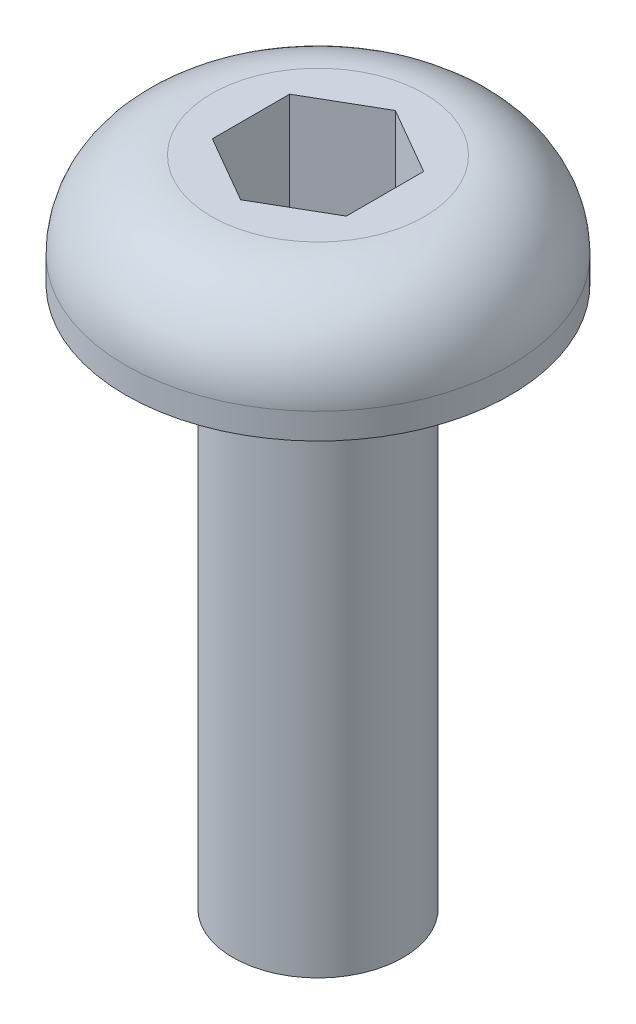
ISO-10303-21;
HEADER;
FILE_DESCRIPTION(('STEP AP214'),'2;1');
FILE_NAME('part.step','',(''),(''),'','','');
FILE_SCHEMA(('AUTOMOTIVE_DESIGN { 1 0 10303 214 1 1 1 1 }'));
ENDSEC;
DATA;
#1=APPLICATION_CONTEXT('core data for automotive mechanical design processes');
#2=APPLICATION_PROTOCOL_DEFINITION('international standard','automotive_design',2000,#1);
#3=PRODUCT_CONTEXT('',#1,'mechanical');
#4=PRODUCT('Part','Part','',(#3));
#5=PRODUCT_RELATED_PRODUCT_CATEGORY('part','',(#4));
#6=PRODUCT_DEFINITION_FORMATION('','',#4);
#7=PRODUCT_DEFINITION_CONTEXT('part definition',#1,'design');
#8=PRODUCT_DEFINITION('design','',#6,#7);
#9=PRODUCT_DEFINITION_SHAPE('','',#8);
#10=(LENGTH_UNIT() NAMED_UNIT(*) SI_UNIT(.MILLI.,.METRE.));
#11=(NAMED_UNIT(*) PLANE_ANGLE_UNIT() SI_UNIT($,.RADIAN.));
#12=(NAMED_UNIT(*) SI_UNIT($,.STERADIAN.) SOLID_ANGLE_UNIT());
#13=UNCERTAINTY_MEASURE_WITH_UNIT(LENGTH_MEASURE(1.E-05),#10,'distance_accuracy_value','');
#14=(GEOMETRIC_REPRESENTATION_CONTEXT(3) GLOBAL_UNCERTAINTY_ASSIGNED_CONTEXT((#13)) GLOBAL_UNIT_ASSIGNED_CONTEXT((#10,
#11,#12)) REPRESENTATION_CONTEXT('',''));
#15=CARTESIAN_POINT('',(0.,0.,0.));
#16=DIRECTION('',(0.,0.,1.));
#17=DIRECTION('',(1.,0.,0.));
#18=AXIS2_PLACEMENT_3D('',#15,#16,#17);
#19=CARTESIAN_POINT('',(0.,0.,0.));
#20=DIRECTION('',(0.,1.,0.));
#21=DIRECTION('',(0.,0.,1.));
#22=AXIS2_PLACEMENT_3D('',#19,#20,#21);
#23=PLANE('',#22);
#24=DIRECTION('',(0.,0.,1.));
#25=VECTOR('',#24,1.);
#26=CARTESIAN_POINT('',(-0.9906,0.,-0.571923176659243));
#27=LINE('',#26,#25);
#28=CARTESIAN_POINT('',(-0.9906,0.,-0.571923176659243));
#29=VERTEX_POINT('',#28);
#30=CARTESIAN_POINT('',(-0.9906,0.,0.571923176659243));
#31=VERTEX_POINT('',#30);
#32=EDGE_CURVE('E82',#29,#31,#27,.T.);
#33=ORIENTED_EDGE('',*,*,#32,.T.);
#34=DIRECTION('',(0.866025403784439,0.,0.5));
#35=VECTOR('',#34,1.);
#36=CARTESIAN_POINT('',(-0.9906,0.,0.571923176659243));
#37=LINE('',#36,#35);
#38=CARTESIAN_POINT('',(0.,0.,1.14384635331849));
#39=VERTEX_POINT('',#38);
#40=EDGE_CURVE('E66',#31,#39,#37,.T.);
#41=ORIENTED_EDGE('',*,*,#40,.T.);
#42=DIRECTION('',(0.866025403784439,0.,-0.5));
#43=VECTOR('',#42,1.);
#44=CARTESIAN_POINT('',(0.,0.,1.14384635331849));
#45=LINE('',#44,#43);
#46=CARTESIAN_POINT('',(0.9906,0.,0.571923176659243));
#47=VERTEX_POINT('',#46);
#48=EDGE_CURVE('E71',#39,#47,#45,.T.);
#49=ORIENTED_EDGE('',*,*,#48,.T.);
#50=DIRECTION('',(0.,0.,-1.));
#51=VECTOR('',#50,1.);
#52=CARTESIAN_POINT('',(0.9906,0.,0.571923176659243));
#53=LINE('',#52,#51);
#54=CARTESIAN_POINT('',(0.9906,0.,-0.571923176659243));
#55=VERTEX_POINT('',#54);
#56=EDGE_CURVE('E131',#47,#55,#53,.T.);
#57=ORIENTED_EDGE('',*,*,#56,.T.);
#58=DIRECTION('',(-0.866025403784439,0.,-0.5));
#59=VECTOR('',#58,1.);
#60=CARTESIAN_POINT('',(0.9906,0.,-0.571923176659243));
#61=LINE('',#60,#59);
#62=CARTESIAN_POINT('',(0.,0.,-1.14384635331849));
#63=VERTEX_POINT('',#62);
#64=EDGE_CURVE('E141',#55,#63,#61,.T.);
#65=ORIENTED_EDGE('',*,*,#64,.T.);
#66=DIRECTION('',(-0.866025403784439,0.,0.5));
#67=VECTOR('',#66,1.);
#68=CARTESIAN_POINT('',(0.,0.,-1.14384635331849));
#69=LINE('',#68,#67);
#70=EDGE_CURVE('E146',#63,#29,#69,.T.);
#71=ORIENTED_EDGE('',*,*,#70,.T.);
#72=EDGE_LOOP('',(#33,#41,#49,#57,#65,#71));
#73=FACE_BOUND('',#72,.T.);
#74=ADVANCED_FACE('F16',(#73),#23,.T.);
#75=CARTESIAN_POINT('',(0.,0.,1.14384635331849));
#76=DIRECTION('',(0.5,0.,0.866025403784439));
#77=DIRECTION('',(0.866025403784439,0.,-0.5));
#78=AXIS2_PLACEMENT_3D('',#75,#76,#77);
#79=PLANE('',#78);
#80=DIRECTION('',(0.,1.,0.));
#81=VECTOR('',#80,1.);
#82=CARTESIAN_POINT('',(0.,0.,1.14384635331849));
#83=LINE('',#82,#81);
#84=CARTESIAN_POINT('',(0.,1.651,1.14384635331849));
#85=VERTEX_POINT('',#84);
#86=EDGE_CURVE('E73',#39,#85,#83,.T.);
#87=ORIENTED_EDGE('',*,*,#86,.T.);
#88=DIRECTION('',(-0.866025403784439,0.,0.5));
#89=VECTOR('',#88,1.);
#90=CARTESIAN_POINT('',(0.9906,1.651,0.571923176659243));
#91=LINE('',#90,#89);
#92=CARTESIAN_POINT('',(0.9906,1.651,0.571923176659243));
#93=VERTEX_POINT('',#92);
#94=EDGE_CURVE('E138',#93,#85,#91,.T.);
#95=ORIENTED_EDGE('',*,*,#94,.F.);
#96=DIRECTION('',(0.,1.,0.));
#97=VECTOR('',#96,1.);
#98=CARTESIAN_POINT('',(0.9906,0.,0.571923176659243));
#99=LINE('',#98,#97);
#100=EDGE_CURVE('E76',#93,#47,#99,.F.);
#101=ORIENTED_EDGE('',*,*,#100,.T.);
#102=ORIENTED_EDGE('',*,*,#48,.F.);
#103=EDGE_LOOP('',(#87,#95,#101,#102));
#104=FACE_BOUND('',#103,.T.);
#105=ADVANCED_FACE('F72',(#104),#79,.F.);
#106=CARTESIAN_POINT('',(-0.9906,0.,0.571923176659243));
#107=DIRECTION('',(-0.5,0.,0.866025403784439));
#108=DIRECTION('',(0.866025403784439,0.,0.5));
#109=AXIS2_PLACEMENT_3D('',#106,#107,#108);
#110=PLANE('',#109);
#111=DIRECTION('',(0.,1.,0.));
#112=VECTOR('',#111,1.);
#113=CARTESIAN_POINT('',(-0.9906,0.,0.571923176659243));
#114=LINE('',#113,#112);
#115=CARTESIAN_POINT('',(-0.9906,1.651,0.571923176659243));
#116=VERTEX_POINT('',#115);
#117=EDGE_CURVE('E84',#31,#116,#114,.T.);
#118=ORIENTED_EDGE('',*,*,#117,.T.);
#119=DIRECTION('',(-0.866025403784439,0.,-0.5));
#120=VECTOR('',#119,1.);
#121=CARTESIAN_POINT('',(0.,1.651,1.14384635331849));
#122=LINE('',#121,#120);
#123=EDGE_CURVE('E88',#85,#116,#122,.T.);
#124=ORIENTED_EDGE('',*,*,#123,.F.);
#125=ORIENTED_EDGE('',*,*,#86,.F.);
#126=ORIENTED_EDGE('',*,*,#40,.F.);
#127=EDGE_LOOP('',(#118,#124,#125,#126));
#128=FACE_BOUND('',#127,.T.);
#129=ADVANCED_FACE('F86',(#128),#110,.F.);
#130=CARTESIAN_POINT('',(-0.9906,0.,-0.571923176659243));
#131=DIRECTION('',(-1.,0.,0.));
#132=DIRECTION('',(0.,0.,1.));
#133=AXIS2_PLACEMENT_3D('',#130,#131,#132);
#134=PLANE('',#133);
#135=DIRECTION('',(0.,1.,0.));
#136=VECTOR('',#135,1.);
#137=CARTESIAN_POINT('',(-0.9906,0.,-0.571923176659243));
#138=LINE('',#137,#136);
#139=CARTESIAN_POINT('',(-0.9906,1.651,-0.571923176659243));
#140=VERTEX_POINT('',#139);
#141=EDGE_CURVE('E148',#29,#140,#138,.T.);
#142=ORIENTED_EDGE('',*,*,#141,.T.);
#143=DIRECTION('',(0.,0.,1.));
#144=VECTOR('',#143,1.);
#145=CARTESIAN_POINT('',(-0.9906,1.651,0.));
#146=LINE('',#145,#144);
#147=EDGE_CURVE('E153',#116,#140,#146,.F.);
#148=ORIENTED_EDGE('',*,*,#147,.F.);
#149=ORIENTED_EDGE('',*,*,#117,.F.);
#150=ORIENTED_EDGE('',*,*,#32,.F.);
#151=EDGE_LOOP('',(#142,#148,#149,#150));
#152=FACE_BOUND('',#151,.T.);
#153=ADVANCED_FACE('F154',(#152),#134,.F.);
#154=CARTESIAN_POINT('',(0.,0.,-1.14384635331849));
#155=DIRECTION('',(-0.5,0.,-0.866025403784439));
#156=DIRECTION('',(-0.866025403784439,0.,0.5));
#157=AXIS2_PLACEMENT_3D('',#154,#155,#156);
#158=PLANE('',#157);
#159=DIRECTION('',(0.,1.,0.));
#160=VECTOR('',#159,1.);
#161=CARTESIAN_POINT('',(0.,0.,-1.14384635331849));
#162=LINE('',#161,#160);
#163=CARTESIAN_POINT('',(0.,1.651,-1.14384635331849));
#164=VERTEX_POINT('',#163);
#165=EDGE_CURVE('E144',#63,#164,#162,.T.);
#166=ORIENTED_EDGE('',*,*,#165,.T.);
#167=DIRECTION('',(0.866025403784439,0.,-0.5));
#168=VECTOR('',#167,1.);
#169=CARTESIAN_POINT('',(-0.9906,1.651,-0.571923176659243));
#170=LINE('',#169,#168);
#171=EDGE_CURVE('E159',#140,#164,#170,.T.);
#172=ORIENTED_EDGE('',*,*,#171,.F.);
#173=ORIENTED_EDGE('',*,*,#141,.F.);
#174=ORIENTED_EDGE('',*,*,#70,.F.);
#175=EDGE_LOOP('',(#166,#172,#173,#174));
#176=FACE_BOUND('',#175,.T.);
#177=ADVANCED_FACE('F181',(#176),#158,.F.);
#178=CARTESIAN_POINT('',(0.9906,0.,-0.571923176659243));
#179=DIRECTION('',(0.5,0.,-0.866025403784439));
#180=DIRECTION('',(-0.866025403784439,0.,-0.5));
#181=AXIS2_PLACEMENT_3D('',#178,#179,#180);
#182=PLANE('',#181);
#183=DIRECTION('',(0.,1.,0.));
#184=VECTOR('',#183,1.);
#185=CARTESIAN_POINT('',(0.9906,0.,-0.571923176659243));
#186=LINE('',#185,#184);
#187=CARTESIAN_POINT('',(0.9906,1.651,-0.571923176659243));
#188=VERTEX_POINT('',#187);
#189=EDGE_CURVE('E34',#55,#188,#186,.T.);
#190=ORIENTED_EDGE('',*,*,#189,.T.);
#191=DIRECTION('',(0.866025403784439,0.,0.5));
#192=VECTOR('',#191,1.);
#193=CARTESIAN_POINT('',(0.,1.651,-1.14384635331849));
#194=LINE('',#193,#192);
#195=EDGE_CURVE('E167',#164,#188,#194,.T.);
#196=ORIENTED_EDGE('',*,*,#195,.F.);
#197=ORIENTED_EDGE('',*,*,#165,.F.);
#198=ORIENTED_EDGE('',*,*,#64,.F.);
#199=EDGE_LOOP('',(#190,#196,#197,#198));
#200=FACE_BOUND('',#199,.T.);
#201=ADVANCED_FACE('F179',(#200),#182,.F.);
#202=CARTESIAN_POINT('',(0.9906,0.,0.571923176659243));
#203=DIRECTION('',(1.,0.,0.));
#204=DIRECTION('',(0.,0.,-1.));
#205=AXIS2_PLACEMENT_3D('',#202,#203,#204);
#206=PLANE('',#205);
#207=ORIENTED_EDGE('',*,*,#100,.F.);
#208=DIRECTION('',(0.,0.,1.));
#209=VECTOR('',#208,1.);
#210=CARTESIAN_POINT('',(0.9906,1.651,0.));
#211=LINE('',#210,#209);
#212=EDGE_CURVE('E105',#188,#93,#211,.T.);
#213=ORIENTED_EDGE('',*,*,#212,.F.);
#214=ORIENTED_EDGE('',*,*,#189,.F.);
#215=ORIENTED_EDGE('',*,*,#56,.F.);
#216=EDGE_LOOP('',(#207,#213,#214,#215));
#217=FACE_BOUND('',#216,.T.);
#218=ADVANCED_FACE('F177',(#217),#206,.F.);
#219=CARTESIAN_POINT('',(0.,1.651,0.));
#220=DIRECTION('',(0.,1.,0.));
#221=DIRECTION('',(0.,0.,1.));
#222=AXIS2_PLACEMENT_3D('',#219,#220,#221);
#223=PLANE('',#222);
#224=ORIENTED_EDGE('',*,*,#195,.T.);
#225=ORIENTED_EDGE('',*,*,#212,.T.);
#226=ORIENTED_EDGE('',*,*,#94,.T.);
#227=ORIENTED_EDGE('',*,*,#123,.T.);
#228=ORIENTED_EDGE('',*,*,#147,.T.);
#229=ORIENTED_EDGE('',*,*,#171,.T.);
#230=EDGE_LOOP('',(#224,#225,#226,#227,#228,#229));
#231=FACE_BOUND('',#230,.T.);
#232=CARTESIAN_POINT('',(0.,1.651,0.));
#233=DIRECTION('',(0.,-1.,0.));
#234=DIRECTION('',(1.,0.,0.));
#235=AXIS2_PLACEMENT_3D('',#232,#233,#234);
#236=CIRCLE('',#235,1.5748);
#237=CARTESIAN_POINT('',(1.5748,1.651,0.));
#238=VERTEX_POINT('',#237);
#239=EDGE_CURVE('E100',#238,#238,#236,.T.);
#240=ORIENTED_EDGE('',*,*,#239,.F.);
#241=EDGE_LOOP('',(#240));
#242=FACE_BOUND('',#241,.T.);
#243=ADVANCED_FACE('F120',(#231,#242),#223,.T.);
#244=CARTESIAN_POINT('',(0.,0.381,0.));
#245=DIRECTION('',(0.,1.,0.));
#246=DIRECTION('',(0.,0.,1.));
#247=AXIS2_PLACEMENT_3D('',#244,#245,#246);
#248=TOROIDAL_SURFACE('',#247,1.5748,1.27);
#249=ORIENTED_EDGE('',*,*,#239,.T.);
#250=EDGE_LOOP('',(#249));
#251=FACE_BOUND('',#250,.T.);
#252=CARTESIAN_POINT('',(0.,0.381,0.));
#253=DIRECTION('',(0.,1.,0.));
#254=DIRECTION('',(0.,0.,1.));
#255=AXIS2_PLACEMENT_3D('',#252,#253,#254);
#256=CIRCLE('',#255,2.8448);
#257=CARTESIAN_POINT('',(0.,0.381,2.8448));
#258=VERTEX_POINT('',#257);
#259=EDGE_CURVE('E96',#258,#258,#256,.F.);
#260=ORIENTED_EDGE('',*,*,#259,.F.);
#261=EDGE_LOOP('',(#260));
#262=FACE_BOUND('',#261,.T.);
#263=ADVANCED_FACE('F114',(#251,#262),#248,.T.);
#264=CARTESIAN_POINT('',(0.,0.,0.));
#265=DIRECTION('',(0.,1.,0.));
#266=DIRECTION('',(0.,0.,1.));
#267=AXIS2_PLACEMENT_3D('',#264,#265,#266);
#268=CYLINDRICAL_SURFACE('',#267,2.8448);
#269=ORIENTED_EDGE('',*,*,#259,.T.);
#270=EDGE_LOOP('',(#269));
#271=FACE_BOUND('',#270,.T.);
#272=CARTESIAN_POINT('',(0.,0.,0.));
#273=DIRECTION('',(0.,1.,0.));
#274=DIRECTION('',(0.,0.,1.));
#275=AXIS2_PLACEMENT_3D('',#272,#273,#274);
#276=CIRCLE('',#275,2.8448);
#277=CARTESIAN_POINT('',(0.,0.,2.8448));
#278=VERTEX_POINT('',#277);
#279=EDGE_CURVE('E19',#278,#278,#276,.T.);
#280=ORIENTED_EDGE('',*,*,#279,.T.);
#281=EDGE_LOOP('',(#280));
#282=FACE_BOUND('',#281,.T.);
#283=ADVANCED_FACE('F119',(#271,#282),#268,.T.);
#284=CARTESIAN_POINT('',(0.,-8.,0.));
#285=DIRECTION('',(0.,1.,0.));
#286=DIRECTION('',(0.,0.,1.));
#287=AXIS2_PLACEMENT_3D('',#284,#285,#286);
#288=PLANE('',#287);
#289=CARTESIAN_POINT('',(0.,-8.,0.));
#290=DIRECTION('',(0.,-1.,0.));
#291=DIRECTION('',(0.,0.,-1.));
#292=AXIS2_PLACEMENT_3D('',#289,#290,#291);
#293=CIRCLE('',#292,1.2573);
#294=CARTESIAN_POINT('',(0.,-8.,-1.2573));
#295=VERTEX_POINT('',#294);
#296=EDGE_CURVE('E25',#295,#295,#293,.F.);
#297=ORIENTED_EDGE('',*,*,#296,.F.);
#298=EDGE_LOOP('',(#297));
#299=FACE_BOUND('',#298,.T.);
#300=ADVANCED_FACE('F199',(#299),#288,.F.);
#301=CARTESIAN_POINT('',(0.,0.,0.));
#302=DIRECTION('',(0.,1.,0.));
#303=DIRECTION('',(0.,0.,1.));
#304=AXIS2_PLACEMENT_3D('',#301,#302,#303);
#305=PLANE('',#304);
#306=CARTESIAN_POINT('',(0.,0.,0.));
#307=DIRECTION('',(0.,-1.,0.));
#308=DIRECTION('',(0.,0.,-1.));
#309=AXIS2_PLACEMENT_3D('',#306,#307,#308);
#310=CIRCLE('',#309,1.2573);
#311=CARTESIAN_POINT('',(0.,0.,-1.2573));
#312=VERTEX_POINT('',#311);
#313=EDGE_CURVE('E11',#312,#312,#310,.T.);
#314=ORIENTED_EDGE('',*,*,#313,.F.);
#315=EDGE_LOOP('',(#314));
#316=FACE_BOUND('',#315,.T.);
#317=ORIENTED_EDGE('',*,*,#279,.F.);
#318=EDGE_LOOP('',(#317));
#319=FACE_BOUND('',#318,.T.);
#320=ADVANCED_FACE('F193',(#316,#319),#305,.F.);
#321=CARTESIAN_POINT('',(0.,0.,0.));
#322=DIRECTION('',(0.,-1.,0.));
#323=DIRECTION('',(0.,0.,-1.));
#324=AXIS2_PLACEMENT_3D('',#321,#322,#323);
#325=CYLINDRICAL_SURFACE('',#324,1.2573);
#326=ORIENTED_EDGE('',*,*,#313,.T.);
#327=EDGE_LOOP('',(#326));
#328=FACE_BOUND('',#327,.T.);
#329=ORIENTED_EDGE('',*,*,#296,.T.);
#330=EDGE_LOOP('',(#329));
#331=FACE_BOUND('',#330,.T.);
#332=ADVANCED_FACE('F191',(#328,#331),#325,.T.);
#333=CLOSED_SHELL('',(#74,#105,#129,#153,#177,#201,#218,#243,#263,#283,#300,#320,#332));
#334=MANIFOLD_SOLID_BREP('B1',#333);
#335=ADVANCED_BREP_SHAPE_REPRESENTATION('',(#18,#334),#14);
#336=SHAPE_DEFINITION_REPRESENTATION(#9,#335);
ENDSEC;
END-ISO-10303-21;
